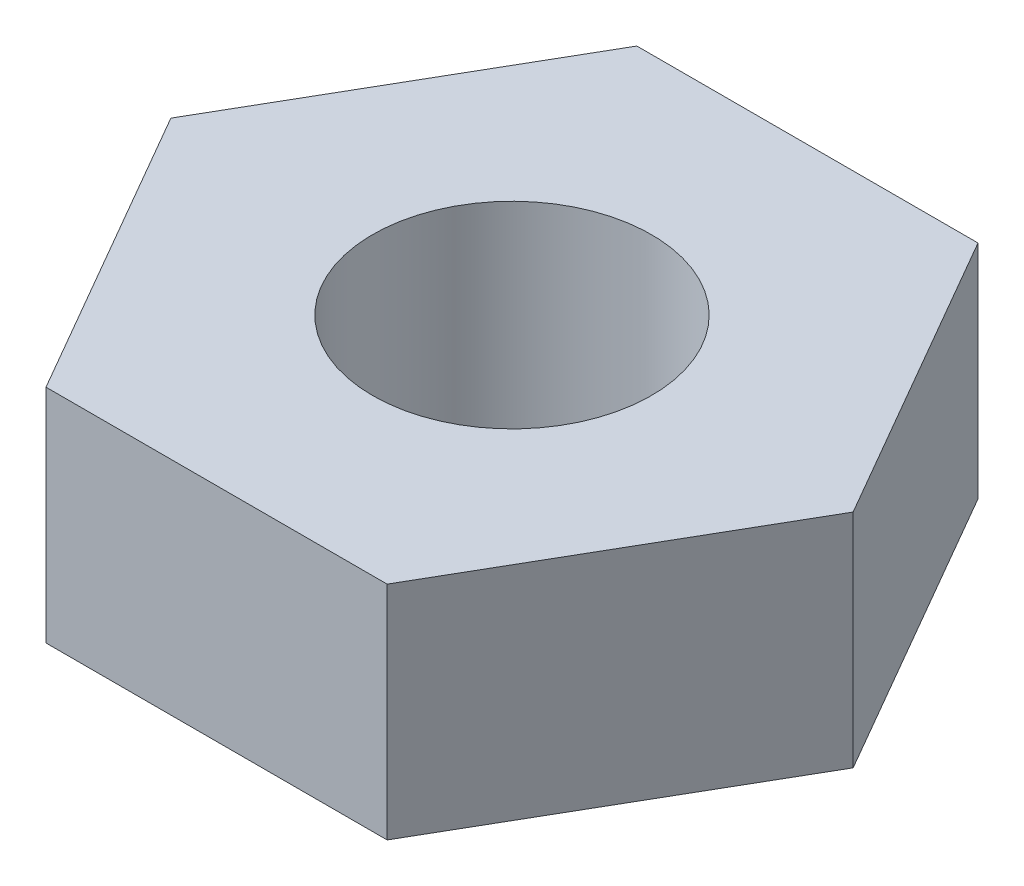
ISO-10303-21;
HEADER;
FILE_DESCRIPTION(('STEP AP214'),'2;1');
FILE_NAME('part.step','',(''),(''),'','','');
FILE_SCHEMA(('AUTOMOTIVE_DESIGN { 1 0 10303 214 1 1 1 1 }'));
ENDSEC;
DATA;
#1=APPLICATION_CONTEXT('core data for automotive mechanical design processes');
#2=APPLICATION_PROTOCOL_DEFINITION('international standard','automotive_design',2000,#1);
#3=PRODUCT_CONTEXT('',#1,'mechanical');
#4=PRODUCT('Part','Part','',(#3));
#5=PRODUCT_RELATED_PRODUCT_CATEGORY('part','',(#4));
#6=PRODUCT_DEFINITION_FORMATION('','',#4);
#7=PRODUCT_DEFINITION_CONTEXT('part definition',#1,'design');
#8=PRODUCT_DEFINITION('design','',#6,#7);
#9=PRODUCT_DEFINITION_SHAPE('','',#8);
#10=(LENGTH_UNIT() NAMED_UNIT(*) SI_UNIT(.MILLI.,.METRE.));
#11=(NAMED_UNIT(*) PLANE_ANGLE_UNIT() SI_UNIT($,.RADIAN.));
#12=(NAMED_UNIT(*) SI_UNIT($,.STERADIAN.) SOLID_ANGLE_UNIT());
#13=UNCERTAINTY_MEASURE_WITH_UNIT(LENGTH_MEASURE(1.E-05),#10,'distance_accuracy_value','');
#14=(GEOMETRIC_REPRESENTATION_CONTEXT(3) GLOBAL_UNCERTAINTY_ASSIGNED_CONTEXT((#13)) GLOBAL_UNIT_ASSIGNED_CONTEXT((#10,
#11,#12)) REPRESENTATION_CONTEXT('',''));
#15=CARTESIAN_POINT('',(0.,0.,0.));
#16=DIRECTION('',(0.,0.,1.));
#17=DIRECTION('',(1.,0.,0.));
#18=AXIS2_PLACEMENT_3D('',#15,#16,#17);
#19=CARTESIAN_POINT('',(1.83308710467706,2.38125,-3.175));
#20=DIRECTION('',(0.,1.,0.));
#21=DIRECTION('',(0.,0.,1.));
#22=AXIS2_PLACEMENT_3D('',#19,#20,#21);
#23=PLANE('',#22);
#24=DIRECTION('',(-0.5,0.,-0.866025403784438));
#25=VECTOR('',#24,1.);
#26=CARTESIAN_POINT('',(3.66617420935413,2.38125,0.));
#27=LINE('',#26,#25);
#28=CARTESIAN_POINT('',(3.66617420935413,2.38125,0.));
#29=VERTEX_POINT('',#28);
#30=CARTESIAN_POINT('',(1.83308710467706,2.38125,-3.175));
#31=VERTEX_POINT('',#30);
#32=EDGE_CURVE('E126',#29,#31,#27,.T.);
#33=ORIENTED_EDGE('',*,*,#32,.T.);
#34=DIRECTION('',(-1.,0.,0.));
#35=VECTOR('',#34,1.);
#36=CARTESIAN_POINT('',(1.83308710467706,2.38125,-3.175));
#37=LINE('',#36,#35);
#38=CARTESIAN_POINT('',(-1.83308710467706,2.38125,-3.175));
#39=VERTEX_POINT('',#38);
#40=EDGE_CURVE('E84',#31,#39,#37,.T.);
#41=ORIENTED_EDGE('',*,*,#40,.T.);
#42=DIRECTION('',(-0.5,0.,0.866025403784439));
#43=VECTOR('',#42,1.);
#44=CARTESIAN_POINT('',(-1.83308710467706,2.38125,-3.175));
#45=LINE('',#44,#43);
#46=CARTESIAN_POINT('',(-3.66617420935412,2.38125,0.));
#47=VERTEX_POINT('',#46);
#48=EDGE_CURVE('E97',#39,#47,#45,.T.);
#49=ORIENTED_EDGE('',*,*,#48,.T.);
#50=DIRECTION('',(0.5,0.,0.866025403784438));
#51=VECTOR('',#50,1.);
#52=CARTESIAN_POINT('',(-3.66617420935412,2.38125,0.));
#53=LINE('',#52,#51);
#54=CARTESIAN_POINT('',(-1.83308710467706,2.38125,3.175));
#55=VERTEX_POINT('',#54);
#56=EDGE_CURVE('E91',#47,#55,#53,.T.);
#57=ORIENTED_EDGE('',*,*,#56,.T.);
#58=DIRECTION('',(1.,0.,0.));
#59=VECTOR('',#58,1.);
#60=CARTESIAN_POINT('',(-1.83308710467706,2.38125,3.175));
#61=LINE('',#60,#59);
#62=CARTESIAN_POINT('',(1.83308710467706,2.38125,3.175));
#63=VERTEX_POINT('',#62);
#64=EDGE_CURVE('E95',#55,#63,#61,.T.);
#65=ORIENTED_EDGE('',*,*,#64,.T.);
#66=DIRECTION('',(0.5,0.,-0.866025403784438));
#67=VECTOR('',#66,1.);
#68=CARTESIAN_POINT('',(1.83308710467706,2.38125,3.175));
#69=LINE('',#68,#67);
#70=EDGE_CURVE('E47',#63,#29,#69,.T.);
#71=ORIENTED_EDGE('',*,*,#70,.T.);
#72=EDGE_LOOP('',(#33,#41,#49,#57,#65,#71));
#73=FACE_BOUND('',#72,.T.);
#74=CARTESIAN_POINT('',(0.,2.38125,0.));
#75=DIRECTION('',(0.,1.,0.));
#76=DIRECTION('',(0.,0.,1.));
#77=AXIS2_PLACEMENT_3D('',#74,#75,#76);
#78=CIRCLE('',#77,1.4986);
#79=CARTESIAN_POINT('',(0.,2.38125,1.4986));
#80=VERTEX_POINT('',#79);
#81=EDGE_CURVE('E119',#80,#80,#78,.T.);
#82=ORIENTED_EDGE('',*,*,#81,.F.);
#83=EDGE_LOOP('',(#82));
#84=FACE_BOUND('',#83,.T.);
#85=ADVANCED_FACE('F30',(#73,#84),#23,.T.);
#86=CARTESIAN_POINT('',(1.83308710467706,0.,-3.175));
#87=DIRECTION('',(0.,1.,0.));
#88=DIRECTION('',(0.,0.,1.));
#89=AXIS2_PLACEMENT_3D('',#86,#87,#88);
#90=PLANE('',#89);
#91=DIRECTION('',(-0.5,0.,-0.866025403784438));
#92=VECTOR('',#91,1.);
#93=CARTESIAN_POINT('',(3.66617420935413,0.,0.));
#94=LINE('',#93,#92);
#95=CARTESIAN_POINT('',(3.66617420935413,0.,0.));
#96=VERTEX_POINT('',#95);
#97=CARTESIAN_POINT('',(1.83308710467706,0.,-3.175));
#98=VERTEX_POINT('',#97);
#99=EDGE_CURVE('E115',#96,#98,#94,.T.);
#100=ORIENTED_EDGE('',*,*,#99,.F.);
#101=DIRECTION('',(0.5,0.,-0.866025403784438));
#102=VECTOR('',#101,1.);
#103=CARTESIAN_POINT('',(1.83308710467706,0.,3.175));
#104=LINE('',#103,#102);
#105=CARTESIAN_POINT('',(1.83308710467706,0.,3.175));
#106=VERTEX_POINT('',#105);
#107=EDGE_CURVE('E76',#106,#96,#104,.T.);
#108=ORIENTED_EDGE('',*,*,#107,.F.);
#109=DIRECTION('',(1.,0.,0.));
#110=VECTOR('',#109,1.);
#111=CARTESIAN_POINT('',(-1.83308710467706,0.,3.175));
#112=LINE('',#111,#110);
#113=CARTESIAN_POINT('',(-1.83308710467706,0.,3.175));
#114=VERTEX_POINT('',#113);
#115=EDGE_CURVE('E70',#114,#106,#112,.T.);
#116=ORIENTED_EDGE('',*,*,#115,.F.);
#117=DIRECTION('',(0.5,0.,0.866025403784438));
#118=VECTOR('',#117,1.);
#119=CARTESIAN_POINT('',(-3.66617420935412,0.,0.));
#120=LINE('',#119,#118);
#121=CARTESIAN_POINT('',(-3.66617420935412,0.,0.));
#122=VERTEX_POINT('',#121);
#123=EDGE_CURVE('E105',#122,#114,#120,.T.);
#124=ORIENTED_EDGE('',*,*,#123,.F.);
#125=DIRECTION('',(-0.5,0.,0.866025403784439));
#126=VECTOR('',#125,1.);
#127=CARTESIAN_POINT('',(-1.83308710467706,0.,-3.175));
#128=LINE('',#127,#126);
#129=CARTESIAN_POINT('',(-1.83308710467706,0.,-3.175));
#130=VERTEX_POINT('',#129);
#131=EDGE_CURVE('E121',#130,#122,#128,.T.);
#132=ORIENTED_EDGE('',*,*,#131,.F.);
#133=DIRECTION('',(-1.,0.,0.));
#134=VECTOR('',#133,1.);
#135=CARTESIAN_POINT('',(1.83308710467706,0.,-3.175));
#136=LINE('',#135,#134);
#137=EDGE_CURVE('E118',#98,#130,#136,.T.);
#138=ORIENTED_EDGE('',*,*,#137,.F.);
#139=EDGE_LOOP('',(#100,#108,#116,#124,#132,#138));
#140=FACE_BOUND('',#139,.T.);
#141=CARTESIAN_POINT('',(0.,0.,0.));
#142=DIRECTION('',(0.,1.,0.));
#143=DIRECTION('',(0.,0.,1.));
#144=AXIS2_PLACEMENT_3D('',#141,#142,#143);
#145=CIRCLE('',#144,1.4986);
#146=CARTESIAN_POINT('',(0.,0.,1.4986));
#147=VERTEX_POINT('',#146);
#148=EDGE_CURVE('E219',#147,#147,#145,.T.);
#149=ORIENTED_EDGE('',*,*,#148,.T.);
#150=EDGE_LOOP('',(#149));
#151=FACE_BOUND('',#150,.T.);
#152=ADVANCED_FACE('F135',(#140,#151),#90,.F.);
#153=CARTESIAN_POINT('',(3.66617420935413,2.38125,0.));
#154=DIRECTION('',(-0.866025403784438,0.,0.5));
#155=DIRECTION('',(0.5,0.,0.866025403784438));
#156=AXIS2_PLACEMENT_3D('',#153,#154,#155);
#157=PLANE('',#156);
#158=ORIENTED_EDGE('',*,*,#99,.T.);
#159=DIRECTION('',(0.,-1.,0.));
#160=VECTOR('',#159,1.);
#161=CARTESIAN_POINT('',(1.83308710467706,2.38125,-3.175));
#162=LINE('',#161,#160);
#163=EDGE_CURVE('E11',#31,#98,#162,.T.);
#164=ORIENTED_EDGE('',*,*,#163,.F.);
#165=ORIENTED_EDGE('',*,*,#32,.F.);
#166=DIRECTION('',(0.,-1.,0.));
#167=VECTOR('',#166,1.);
#168=CARTESIAN_POINT('',(3.66617420935413,2.38125,0.));
#169=LINE('',#168,#167);
#170=EDGE_CURVE('E111',#29,#96,#169,.T.);
#171=ORIENTED_EDGE('',*,*,#170,.T.);
#172=EDGE_LOOP('',(#158,#164,#165,#171));
#173=FACE_BOUND('',#172,.T.);
#174=ADVANCED_FACE('F32',(#173),#157,.F.);
#175=CARTESIAN_POINT('',(1.83308710467706,2.38125,-3.175));
#176=DIRECTION('',(0.,0.,1.));
#177=DIRECTION('',(1.,0.,0.));
#178=AXIS2_PLACEMENT_3D('',#175,#176,#177);
#179=PLANE('',#178);
#180=ORIENTED_EDGE('',*,*,#137,.T.);
#181=DIRECTION('',(0.,-1.,0.));
#182=VECTOR('',#181,1.);
#183=CARTESIAN_POINT('',(-1.83308710467706,2.38125,-3.175));
#184=LINE('',#183,#182);
#185=EDGE_CURVE('E39',#39,#130,#184,.T.);
#186=ORIENTED_EDGE('',*,*,#185,.F.);
#187=ORIENTED_EDGE('',*,*,#40,.F.);
#188=ORIENTED_EDGE('',*,*,#163,.T.);
#189=EDGE_LOOP('',(#180,#186,#187,#188));
#190=FACE_BOUND('',#189,.T.);
#191=ADVANCED_FACE('F160',(#190),#179,.F.);
#192=CARTESIAN_POINT('',(-1.83308710467706,2.38125,-3.175));
#193=DIRECTION('',(0.866025403784439,0.,0.5));
#194=DIRECTION('',(0.5,0.,-0.866025403784439));
#195=AXIS2_PLACEMENT_3D('',#192,#193,#194);
#196=PLANE('',#195);
#197=ORIENTED_EDGE('',*,*,#131,.T.);
#198=DIRECTION('',(0.,-1.,0.));
#199=VECTOR('',#198,1.);
#200=CARTESIAN_POINT('',(-3.66617420935412,2.38125,0.));
#201=LINE('',#200,#199);
#202=EDGE_CURVE('E106',#47,#122,#201,.T.);
#203=ORIENTED_EDGE('',*,*,#202,.F.);
#204=ORIENTED_EDGE('',*,*,#48,.F.);
#205=ORIENTED_EDGE('',*,*,#185,.T.);
#206=EDGE_LOOP('',(#197,#203,#204,#205));
#207=FACE_BOUND('',#206,.T.);
#208=ADVANCED_FACE('F132',(#207),#196,.F.);
#209=CARTESIAN_POINT('',(-3.66617420935412,2.38125,0.));
#210=DIRECTION('',(0.866025403784439,0.,-0.5));
#211=DIRECTION('',(-0.5,0.,-0.866025403784439));
#212=AXIS2_PLACEMENT_3D('',#209,#210,#211);
#213=PLANE('',#212);
#214=ORIENTED_EDGE('',*,*,#123,.T.);
#215=DIRECTION('',(0.,-1.,0.));
#216=VECTOR('',#215,1.);
#217=CARTESIAN_POINT('',(-1.83308710467706,2.38125,3.175));
#218=LINE('',#217,#216);
#219=EDGE_CURVE('E102',#55,#114,#218,.T.);
#220=ORIENTED_EDGE('',*,*,#219,.F.);
#221=ORIENTED_EDGE('',*,*,#56,.F.);
#222=ORIENTED_EDGE('',*,*,#202,.T.);
#223=EDGE_LOOP('',(#214,#220,#221,#222));
#224=FACE_BOUND('',#223,.T.);
#225=ADVANCED_FACE('F103',(#224),#213,.F.);
#226=CARTESIAN_POINT('',(-1.83308710467706,2.38125,3.175));
#227=DIRECTION('',(0.,0.,-1.));
#228=DIRECTION('',(-1.,0.,0.));
#229=AXIS2_PLACEMENT_3D('',#226,#227,#228);
#230=PLANE('',#229);
#231=ORIENTED_EDGE('',*,*,#115,.T.);
#232=DIRECTION('',(0.,-1.,0.));
#233=VECTOR('',#232,1.);
#234=CARTESIAN_POINT('',(1.83308710467706,2.38125,3.175));
#235=LINE('',#234,#233);
#236=EDGE_CURVE('E107',#63,#106,#235,.T.);
#237=ORIENTED_EDGE('',*,*,#236,.F.);
#238=ORIENTED_EDGE('',*,*,#64,.F.);
#239=ORIENTED_EDGE('',*,*,#219,.T.);
#240=EDGE_LOOP('',(#231,#237,#238,#239));
#241=FACE_BOUND('',#240,.T.);
#242=ADVANCED_FACE('F109',(#241),#230,.F.);
#243=CARTESIAN_POINT('',(1.83308710467706,2.38125,3.175));
#244=DIRECTION('',(-0.866025403784439,0.,-0.5));
#245=DIRECTION('',(-0.5,0.,0.866025403784439));
#246=AXIS2_PLACEMENT_3D('',#243,#244,#245);
#247=PLANE('',#246);
#248=ORIENTED_EDGE('',*,*,#107,.T.);
#249=ORIENTED_EDGE('',*,*,#170,.F.);
#250=ORIENTED_EDGE('',*,*,#70,.F.);
#251=ORIENTED_EDGE('',*,*,#236,.T.);
#252=EDGE_LOOP('',(#248,#249,#250,#251));
#253=FACE_BOUND('',#252,.T.);
#254=ADVANCED_FACE('F140',(#253),#247,.F.);
#255=CARTESIAN_POINT('',(0.,2.38125,0.));
#256=DIRECTION('',(0.,-1.,0.));
#257=DIRECTION('',(0.,0.,-1.));
#258=AXIS2_PLACEMENT_3D('',#255,#256,#257);
#259=CYLINDRICAL_SURFACE('',#258,1.4986);
#260=ORIENTED_EDGE('',*,*,#81,.T.);
#261=EDGE_LOOP('',(#260));
#262=FACE_BOUND('',#261,.T.);
#263=ORIENTED_EDGE('',*,*,#148,.F.);
#264=EDGE_LOOP('',(#263));
#265=FACE_BOUND('',#264,.T.);
#266=ADVANCED_FACE('F142',(#262,#265),#259,.F.);
#267=CLOSED_SHELL('',(#85,#152,#174,#191,#208,#225,#242,#254,#266));
#268=MANIFOLD_SOLID_BREP('B2',#267);
#269=ADVANCED_BREP_SHAPE_REPRESENTATION('',(#18,#268),#14);
#270=SHAPE_DEFINITION_REPRESENTATION(#9,#269);
ENDSEC;
END-ISO-10303-21;
